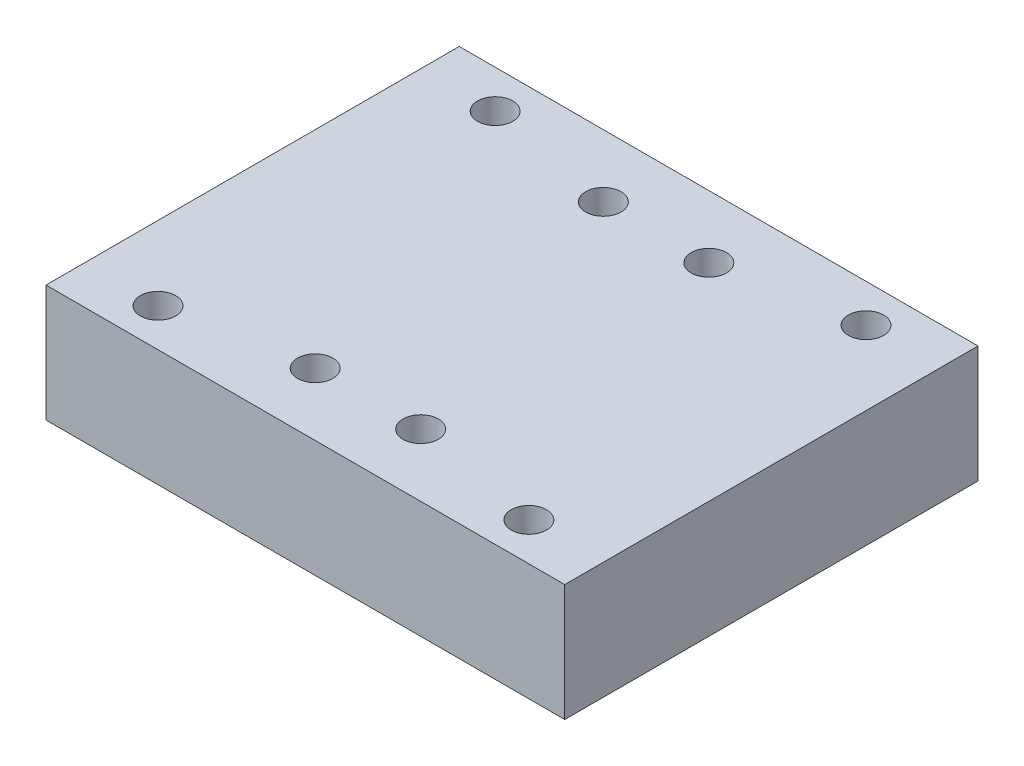
ISO-10303-21;
HEADER;
FILE_DESCRIPTION(('STEP AP214'),'2;1');
FILE_NAME('part.step','',(''),(''),'','','');
FILE_SCHEMA(('AUTOMOTIVE_DESIGN { 1 0 10303 214 1 1 1 1 }'));
ENDSEC;
DATA;
#1=APPLICATION_CONTEXT('core data for automotive mechanical design processes');
#2=APPLICATION_PROTOCOL_DEFINITION('international standard','automotive_design',2000,#1);
#3=PRODUCT_CONTEXT('',#1,'mechanical');
#4=PRODUCT('Part','Part','',(#3));
#5=PRODUCT_RELATED_PRODUCT_CATEGORY('part','',(#4));
#6=PRODUCT_DEFINITION_FORMATION('','',#4);
#7=PRODUCT_DEFINITION_CONTEXT('part definition',#1,'design');
#8=PRODUCT_DEFINITION('design','',#6,#7);
#9=PRODUCT_DEFINITION_SHAPE('','',#8);
#10=(LENGTH_UNIT() NAMED_UNIT(*) SI_UNIT(.MILLI.,.METRE.));
#11=(NAMED_UNIT(*) PLANE_ANGLE_UNIT() SI_UNIT($,.RADIAN.));
#12=(NAMED_UNIT(*) SI_UNIT($,.STERADIAN.) SOLID_ANGLE_UNIT());
#13=UNCERTAINTY_MEASURE_WITH_UNIT(LENGTH_MEASURE(1.E-05),#10,'distance_accuracy_value','');
#14=(GEOMETRIC_REPRESENTATION_CONTEXT(3) GLOBAL_UNCERTAINTY_ASSIGNED_CONTEXT((#13)) GLOBAL_UNIT_ASSIGNED_CONTEXT((#10,
#11,#12)) REPRESENTATION_CONTEXT('',''));
#15=CARTESIAN_POINT('',(0.,0.,0.));
#16=DIRECTION('',(0.,0.,1.));
#17=DIRECTION('',(1.,0.,0.));
#18=AXIS2_PLACEMENT_3D('',#15,#16,#17);
#19=CARTESIAN_POINT('',(47.7,21.5,38.));
#20=DIRECTION('',(-1.,0.,0.));
#21=DIRECTION('',(0.,0.,1.));
#22=AXIS2_PLACEMENT_3D('',#19,#20,#21);
#23=PLANE('',#22);
#24=DIRECTION('',(0.,0.,-1.));
#25=VECTOR('',#24,1.);
#26=CARTESIAN_POINT('',(47.7,0.,38.));
#27=LINE('',#26,#25);
#28=CARTESIAN_POINT('',(47.7,0.,38.));
#29=VERTEX_POINT('',#28);
#30=CARTESIAN_POINT('',(47.7,0.,-38.));
#31=VERTEX_POINT('',#30);
#32=EDGE_CURVE('E110',#29,#31,#27,.T.);
#33=ORIENTED_EDGE('',*,*,#32,.T.);
#34=DIRECTION('',(0.,-1.,0.));
#35=VECTOR('',#34,1.);
#36=CARTESIAN_POINT('',(47.7,21.5,-38.));
#37=LINE('',#36,#35);
#38=CARTESIAN_POINT('',(47.7,21.5,-38.));
#39=VERTEX_POINT('',#38);
#40=EDGE_CURVE('E11',#39,#31,#37,.T.);
#41=ORIENTED_EDGE('',*,*,#40,.F.);
#42=DIRECTION('',(0.,0.,-1.));
#43=VECTOR('',#42,1.);
#44=CARTESIAN_POINT('',(47.7,21.5,38.));
#45=LINE('',#44,#43);
#46=CARTESIAN_POINT('',(47.7,21.5,38.));
#47=VERTEX_POINT('',#46);
#48=EDGE_CURVE('E94',#47,#39,#45,.T.);
#49=ORIENTED_EDGE('',*,*,#48,.F.);
#50=DIRECTION('',(0.,-1.,0.));
#51=VECTOR('',#50,1.);
#52=CARTESIAN_POINT('',(47.7,21.5,38.));
#53=LINE('',#52,#51);
#54=EDGE_CURVE('E106',#47,#29,#53,.T.);
#55=ORIENTED_EDGE('',*,*,#54,.T.);
#56=EDGE_LOOP('',(#33,#41,#49,#55));
#57=FACE_BOUND('',#56,.T.);
#58=ADVANCED_FACE('F42',(#57),#23,.F.);
#59=CARTESIAN_POINT('',(-47.7,21.5,-38.));
#60=DIRECTION('',(0.,0.,1.));
#61=DIRECTION('',(1.,0.,0.));
#62=AXIS2_PLACEMENT_3D('',#59,#60,#61);
#63=PLANE('',#62);
#64=DIRECTION('',(-1.,0.,0.));
#65=VECTOR('',#64,1.);
#66=CARTESIAN_POINT('',(-47.7,0.,-38.));
#67=LINE('',#66,#65);
#68=CARTESIAN_POINT('',(-47.7,0.,-38.));
#69=VERTEX_POINT('',#68);
#70=EDGE_CURVE('E99',#31,#69,#67,.T.);
#71=ORIENTED_EDGE('',*,*,#70,.T.);
#72=DIRECTION('',(0.,-1.,0.));
#73=VECTOR('',#72,1.);
#74=CARTESIAN_POINT('',(-47.7,21.5,-38.));
#75=LINE('',#74,#73);
#76=CARTESIAN_POINT('',(-47.7,21.5,-38.));
#77=VERTEX_POINT('',#76);
#78=EDGE_CURVE('E51',#77,#69,#75,.T.);
#79=ORIENTED_EDGE('',*,*,#78,.F.);
#80=DIRECTION('',(-1.,0.,0.));
#81=VECTOR('',#80,1.);
#82=CARTESIAN_POINT('',(-47.7,21.5,-38.));
#83=LINE('',#82,#81);
#84=EDGE_CURVE('E89',#39,#77,#83,.T.);
#85=ORIENTED_EDGE('',*,*,#84,.F.);
#86=ORIENTED_EDGE('',*,*,#40,.T.);
#87=EDGE_LOOP('',(#71,#79,#85,#86));
#88=FACE_BOUND('',#87,.T.);
#89=ADVANCED_FACE('F98',(#88),#63,.F.);
#90=CARTESIAN_POINT('',(-47.7,21.5,38.));
#91=DIRECTION('',(1.,0.,0.));
#92=DIRECTION('',(0.,0.,-1.));
#93=AXIS2_PLACEMENT_3D('',#90,#91,#92);
#94=PLANE('',#93);
#95=DIRECTION('',(0.,0.,1.));
#96=VECTOR('',#95,1.);
#97=CARTESIAN_POINT('',(-47.7,0.,38.));
#98=LINE('',#97,#96);
#99=CARTESIAN_POINT('',(-47.7,0.,38.));
#100=VERTEX_POINT('',#99);
#101=EDGE_CURVE('E76',#69,#100,#98,.T.);
#102=ORIENTED_EDGE('',*,*,#101,.T.);
#103=DIRECTION('',(0.,-1.,0.));
#104=VECTOR('',#103,1.);
#105=CARTESIAN_POINT('',(-47.7,21.5,38.));
#106=LINE('',#105,#104);
#107=CARTESIAN_POINT('',(-47.7,21.5,38.));
#108=VERTEX_POINT('',#107);
#109=EDGE_CURVE('E101',#108,#100,#106,.T.);
#110=ORIENTED_EDGE('',*,*,#109,.F.);
#111=DIRECTION('',(0.,0.,1.));
#112=VECTOR('',#111,1.);
#113=CARTESIAN_POINT('',(-47.7,21.5,38.));
#114=LINE('',#113,#112);
#115=EDGE_CURVE('E92',#77,#108,#114,.T.);
#116=ORIENTED_EDGE('',*,*,#115,.F.);
#117=ORIENTED_EDGE('',*,*,#78,.T.);
#118=EDGE_LOOP('',(#102,#110,#116,#117));
#119=FACE_BOUND('',#118,.T.);
#120=ADVANCED_FACE('F102',(#119),#94,.F.);
#121=CARTESIAN_POINT('',(-47.7,21.5,38.));
#122=DIRECTION('',(0.,0.,-1.));
#123=DIRECTION('',(-1.,0.,0.));
#124=AXIS2_PLACEMENT_3D('',#121,#122,#123);
#125=PLANE('',#124);
#126=DIRECTION('',(1.,0.,0.));
#127=VECTOR('',#126,1.);
#128=CARTESIAN_POINT('',(-47.7,0.,38.));
#129=LINE('',#128,#127);
#130=EDGE_CURVE('E82',#100,#29,#129,.T.);
#131=ORIENTED_EDGE('',*,*,#130,.T.);
#132=ORIENTED_EDGE('',*,*,#54,.F.);
#133=DIRECTION('',(1.,0.,0.));
#134=VECTOR('',#133,1.);
#135=CARTESIAN_POINT('',(-47.7,21.5,38.));
#136=LINE('',#135,#134);
#137=EDGE_CURVE('E59',#108,#47,#136,.T.);
#138=ORIENTED_EDGE('',*,*,#137,.F.);
#139=ORIENTED_EDGE('',*,*,#109,.T.);
#140=EDGE_LOOP('',(#131,#132,#138,#139));
#141=FACE_BOUND('',#140,.T.);
#142=ADVANCED_FACE('F124',(#141),#125,.F.);
#143=CARTESIAN_POINT('',(0.,21.5,0.));
#144=DIRECTION('',(0.,-1.,0.));
#145=DIRECTION('',(0.,0.,-1.));
#146=AXIS2_PLACEMENT_3D('',#143,#144,#145);
#147=PLANE('',#146);
#148=CARTESIAN_POINT('',(34.1,21.5,31.));
#149=DIRECTION('',(0.,1.,0.));
#150=DIRECTION('',(0.,0.,-1.));
#151=AXIS2_PLACEMENT_3D('',#148,#149,#150);
#152=CIRCLE('',#151,3.25);
#153=CARTESIAN_POINT('',(34.1,21.5,27.75));
#154=VERTEX_POINT('',#153);
#155=EDGE_CURVE('E187',#154,#154,#152,.T.);
#156=ORIENTED_EDGE('',*,*,#155,.F.);
#157=EDGE_LOOP('',(#156));
#158=FACE_BOUND('',#157,.T.);
#159=CARTESIAN_POINT('',(9.70000000000002,21.5,26.5));
#160=DIRECTION('',(0.,1.,0.));
#161=DIRECTION('',(0.,0.,-1.));
#162=AXIS2_PLACEMENT_3D('',#159,#160,#161);
#163=CIRCLE('',#162,3.25);
#164=CARTESIAN_POINT('',(9.70000000000002,21.5,23.25));
#165=VERTEX_POINT('',#164);
#166=EDGE_CURVE('E179',#165,#165,#163,.T.);
#167=ORIENTED_EDGE('',*,*,#166,.F.);
#168=EDGE_LOOP('',(#167));
#169=FACE_BOUND('',#168,.T.);
#170=CARTESIAN_POINT('',(34.1,21.5,-31.));
#171=DIRECTION('',(0.,-1.,0.));
#172=DIRECTION('',(0.,0.,1.));
#173=AXIS2_PLACEMENT_3D('',#170,#171,#172);
#174=CIRCLE('',#173,3.25);
#175=CARTESIAN_POINT('',(34.1,21.5,-27.75));
#176=VERTEX_POINT('',#175);
#177=EDGE_CURVE('E172',#176,#176,#174,.T.);
#178=ORIENTED_EDGE('',*,*,#177,.T.);
#179=EDGE_LOOP('',(#178));
#180=FACE_BOUND('',#179,.T.);
#181=CARTESIAN_POINT('',(9.70000000000002,21.5,-26.5));
#182=DIRECTION('',(0.,-1.,0.));
#183=DIRECTION('',(0.,0.,1.));
#184=AXIS2_PLACEMENT_3D('',#181,#182,#183);
#185=CIRCLE('',#184,3.25);
#186=CARTESIAN_POINT('',(9.70000000000002,21.5,-23.25));
#187=VERTEX_POINT('',#186);
#188=EDGE_CURVE('E163',#187,#187,#185,.T.);
#189=ORIENTED_EDGE('',*,*,#188,.T.);
#190=EDGE_LOOP('',(#189));
#191=FACE_BOUND('',#190,.T.);
#192=CARTESIAN_POINT('',(-34.1,21.5,31.));
#193=DIRECTION('',(0.,-1.,0.));
#194=DIRECTION('',(0.,0.,-1.));
#195=AXIS2_PLACEMENT_3D('',#192,#193,#194);
#196=CIRCLE('',#195,3.25);
#197=CARTESIAN_POINT('',(-34.1,21.5,27.75));
#198=VERTEX_POINT('',#197);
#199=EDGE_CURVE('E156',#198,#198,#196,.T.);
#200=ORIENTED_EDGE('',*,*,#199,.T.);
#201=EDGE_LOOP('',(#200));
#202=FACE_BOUND('',#201,.T.);
#203=CARTESIAN_POINT('',(-9.70000000000002,21.5,26.5));
#204=DIRECTION('',(0.,-1.,0.));
#205=DIRECTION('',(0.,0.,-1.));
#206=AXIS2_PLACEMENT_3D('',#203,#204,#205);
#207=CIRCLE('',#206,3.25);
#208=CARTESIAN_POINT('',(-9.70000000000002,21.5,23.25));
#209=VERTEX_POINT('',#208);
#210=EDGE_CURVE('E147',#209,#209,#207,.T.);
#211=ORIENTED_EDGE('',*,*,#210,.T.);
#212=EDGE_LOOP('',(#211));
#213=FACE_BOUND('',#212,.T.);
#214=CARTESIAN_POINT('',(-34.1,21.5,-31.));
#215=DIRECTION('',(0.,1.,0.));
#216=DIRECTION('',(0.,0.,1.));
#217=AXIS2_PLACEMENT_3D('',#214,#215,#216);
#218=CIRCLE('',#217,3.25);
#219=CARTESIAN_POINT('',(-34.1,21.5,-27.75));
#220=VERTEX_POINT('',#219);
#221=EDGE_CURVE('E140',#220,#220,#218,.T.);
#222=ORIENTED_EDGE('',*,*,#221,.F.);
#223=EDGE_LOOP('',(#222));
#224=FACE_BOUND('',#223,.T.);
#225=CARTESIAN_POINT('',(-9.70000000000002,21.5,-26.5));
#226=DIRECTION('',(0.,1.,0.));
#227=DIRECTION('',(0.,0.,1.));
#228=AXIS2_PLACEMENT_3D('',#225,#226,#227);
#229=CIRCLE('',#228,3.25);
#230=CARTESIAN_POINT('',(-9.70000000000002,21.5,-23.25));
#231=VERTEX_POINT('',#230);
#232=EDGE_CURVE('E135',#231,#231,#229,.T.);
#233=ORIENTED_EDGE('',*,*,#232,.F.);
#234=EDGE_LOOP('',(#233));
#235=FACE_BOUND('',#234,.T.);
#236=ORIENTED_EDGE('',*,*,#48,.T.);
#237=ORIENTED_EDGE('',*,*,#84,.T.);
#238=ORIENTED_EDGE('',*,*,#115,.T.);
#239=ORIENTED_EDGE('',*,*,#137,.T.);
#240=EDGE_LOOP('',(#236,#237,#238,#239));
#241=FACE_BOUND('',#240,.T.);
#242=ADVANCED_FACE('F90',(#158,#169,#180,#191,#202,#213,#224,#235,#241),#147,.F.);
#243=CARTESIAN_POINT('',(0.,0.,0.));
#244=DIRECTION('',(0.,-1.,0.));
#245=DIRECTION('',(0.,0.,-1.));
#246=AXIS2_PLACEMENT_3D('',#243,#244,#245);
#247=PLANE('',#246);
#248=CARTESIAN_POINT('',(34.1,0.,31.));
#249=DIRECTION('',(0.,1.,0.));
#250=DIRECTION('',(0.,0.,-1.));
#251=AXIS2_PLACEMENT_3D('',#248,#249,#250);
#252=CIRCLE('',#251,3.25);
#253=CARTESIAN_POINT('',(34.1,0.,27.75));
#254=VERTEX_POINT('',#253);
#255=EDGE_CURVE('E168',#254,#254,#252,.T.);
#256=ORIENTED_EDGE('',*,*,#255,.T.);
#257=EDGE_LOOP('',(#256));
#258=FACE_BOUND('',#257,.T.);
#259=CARTESIAN_POINT('',(9.70000000000002,0.,26.5));
#260=DIRECTION('',(0.,1.,0.));
#261=DIRECTION('',(0.,0.,-1.));
#262=AXIS2_PLACEMENT_3D('',#259,#260,#261);
#263=CIRCLE('',#262,3.25);
#264=CARTESIAN_POINT('',(9.70000000000002,0.,23.25));
#265=VERTEX_POINT('',#264);
#266=EDGE_CURVE('E183',#265,#265,#263,.T.);
#267=ORIENTED_EDGE('',*,*,#266,.T.);
#268=EDGE_LOOP('',(#267));
#269=FACE_BOUND('',#268,.T.);
#270=CARTESIAN_POINT('',(34.1,0.,-31.));
#271=DIRECTION('',(0.,-1.,0.));
#272=DIRECTION('',(0.,0.,1.));
#273=AXIS2_PLACEMENT_3D('',#270,#271,#272);
#274=CIRCLE('',#273,3.25);
#275=CARTESIAN_POINT('',(34.1,0.,-27.75));
#276=VERTEX_POINT('',#275);
#277=EDGE_CURVE('E152',#276,#276,#274,.T.);
#278=ORIENTED_EDGE('',*,*,#277,.F.);
#279=EDGE_LOOP('',(#278));
#280=FACE_BOUND('',#279,.T.);
#281=CARTESIAN_POINT('',(9.70000000000002,0.,-26.5));
#282=DIRECTION('',(0.,-1.,0.));
#283=DIRECTION('',(0.,0.,1.));
#284=AXIS2_PLACEMENT_3D('',#281,#282,#283);
#285=CIRCLE('',#284,3.25);
#286=CARTESIAN_POINT('',(9.70000000000002,0.,-23.25));
#287=VERTEX_POINT('',#286);
#288=EDGE_CURVE('E167',#287,#287,#285,.T.);
#289=ORIENTED_EDGE('',*,*,#288,.F.);
#290=EDGE_LOOP('',(#289));
#291=FACE_BOUND('',#290,.T.);
#292=CARTESIAN_POINT('',(-34.1,0.,31.));
#293=DIRECTION('',(0.,-1.,0.));
#294=DIRECTION('',(0.,0.,-1.));
#295=AXIS2_PLACEMENT_3D('',#292,#293,#294);
#296=CIRCLE('',#295,3.25);
#297=CARTESIAN_POINT('',(-34.1,0.,27.75));
#298=VERTEX_POINT('',#297);
#299=EDGE_CURVE('E136',#298,#298,#296,.T.);
#300=ORIENTED_EDGE('',*,*,#299,.F.);
#301=EDGE_LOOP('',(#300));
#302=FACE_BOUND('',#301,.T.);
#303=CARTESIAN_POINT('',(-9.70000000000002,0.,26.5));
#304=DIRECTION('',(0.,-1.,0.));
#305=DIRECTION('',(0.,0.,-1.));
#306=AXIS2_PLACEMENT_3D('',#303,#304,#305);
#307=CIRCLE('',#306,3.25);
#308=CARTESIAN_POINT('',(-9.70000000000002,0.,23.25));
#309=VERTEX_POINT('',#308);
#310=EDGE_CURVE('E151',#309,#309,#307,.T.);
#311=ORIENTED_EDGE('',*,*,#310,.F.);
#312=EDGE_LOOP('',(#311));
#313=FACE_BOUND('',#312,.T.);
#314=CARTESIAN_POINT('',(-34.1,0.,-31.));
#315=DIRECTION('',(0.,1.,0.));
#316=DIRECTION('',(0.,0.,1.));
#317=AXIS2_PLACEMENT_3D('',#314,#315,#316);
#318=CIRCLE('',#317,3.25);
#319=CARTESIAN_POINT('',(-34.1,0.,-27.75));
#320=VERTEX_POINT('',#319);
#321=EDGE_CURVE('E114',#320,#320,#318,.T.);
#322=ORIENTED_EDGE('',*,*,#321,.T.);
#323=EDGE_LOOP('',(#322));
#324=FACE_BOUND('',#323,.T.);
#325=CARTESIAN_POINT('',(-9.70000000000002,0.,-26.5));
#326=DIRECTION('',(0.,1.,0.));
#327=DIRECTION('',(0.,0.,1.));
#328=AXIS2_PLACEMENT_3D('',#325,#326,#327);
#329=CIRCLE('',#328,3.25);
#330=CARTESIAN_POINT('',(-9.70000000000002,0.,-23.25));
#331=VERTEX_POINT('',#330);
#332=EDGE_CURVE('E131',#331,#331,#329,.T.);
#333=ORIENTED_EDGE('',*,*,#332,.T.);
#334=EDGE_LOOP('',(#333));
#335=FACE_BOUND('',#334,.T.);
#336=ORIENTED_EDGE('',*,*,#32,.F.);
#337=ORIENTED_EDGE('',*,*,#130,.F.);
#338=ORIENTED_EDGE('',*,*,#101,.F.);
#339=ORIENTED_EDGE('',*,*,#70,.F.);
#340=EDGE_LOOP('',(#336,#337,#338,#339));
#341=FACE_BOUND('',#340,.T.);
#342=ADVANCED_FACE('F127',(#258,#269,#280,#291,#302,#313,#324,#335,#341),#247,.T.);
#343=CARTESIAN_POINT('',(-9.70000000000002,0.,-26.5));
#344=DIRECTION('',(0.,1.,0.));
#345=DIRECTION('',(0.,0.,1.));
#346=AXIS2_PLACEMENT_3D('',#343,#344,#345);
#347=CYLINDRICAL_SURFACE('',#346,3.25);
#348=ORIENTED_EDGE('',*,*,#332,.F.);
#349=EDGE_LOOP('',(#348));
#350=FACE_BOUND('',#349,.T.);
#351=ORIENTED_EDGE('',*,*,#232,.T.);
#352=EDGE_LOOP('',(#351));
#353=FACE_BOUND('',#352,.T.);
#354=ADVANCED_FACE('F221',(#350,#353),#347,.F.);
#355=CARTESIAN_POINT('',(-34.1,0.,-31.));
#356=DIRECTION('',(0.,1.,0.));
#357=DIRECTION('',(0.,0.,1.));
#358=AXIS2_PLACEMENT_3D('',#355,#356,#357);
#359=CYLINDRICAL_SURFACE('',#358,3.25);
#360=ORIENTED_EDGE('',*,*,#321,.F.);
#361=EDGE_LOOP('',(#360));
#362=FACE_BOUND('',#361,.T.);
#363=ORIENTED_EDGE('',*,*,#221,.T.);
#364=EDGE_LOOP('',(#363));
#365=FACE_BOUND('',#364,.T.);
#366=ADVANCED_FACE('F223',(#362,#365),#359,.F.);
#367=CARTESIAN_POINT('',(-9.70000000000002,0.,26.5));
#368=DIRECTION('',(0.,1.,0.));
#369=DIRECTION('',(0.,0.,1.));
#370=AXIS2_PLACEMENT_3D('',#367,#368,#369);
#371=CYLINDRICAL_SURFACE('',#370,3.25);
#372=ORIENTED_EDGE('',*,*,#310,.T.);
#373=EDGE_LOOP('',(#372));
#374=FACE_BOUND('',#373,.T.);
#375=ORIENTED_EDGE('',*,*,#210,.F.);
#376=EDGE_LOOP('',(#375));
#377=FACE_BOUND('',#376,.T.);
#378=ADVANCED_FACE('F230',(#374,#377),#371,.F.);
#379=CARTESIAN_POINT('',(-34.1,0.,31.));
#380=DIRECTION('',(0.,1.,0.));
#381=DIRECTION('',(0.,0.,1.));
#382=AXIS2_PLACEMENT_3D('',#379,#380,#381);
#383=CYLINDRICAL_SURFACE('',#382,3.25);
#384=ORIENTED_EDGE('',*,*,#299,.T.);
#385=EDGE_LOOP('',(#384));
#386=FACE_BOUND('',#385,.T.);
#387=ORIENTED_EDGE('',*,*,#199,.F.);
#388=EDGE_LOOP('',(#387));
#389=FACE_BOUND('',#388,.T.);
#390=ADVANCED_FACE('F272',(#386,#389),#383,.F.);
#391=CARTESIAN_POINT('',(9.70000000000002,0.,-26.5));
#392=DIRECTION('',(0.,1.,0.));
#393=DIRECTION('',(0.,0.,1.));
#394=AXIS2_PLACEMENT_3D('',#391,#392,#393);
#395=CYLINDRICAL_SURFACE('',#394,3.25);
#396=ORIENTED_EDGE('',*,*,#288,.T.);
#397=EDGE_LOOP('',(#396));
#398=FACE_BOUND('',#397,.T.);
#399=ORIENTED_EDGE('',*,*,#188,.F.);
#400=EDGE_LOOP('',(#399));
#401=FACE_BOUND('',#400,.T.);
#402=ADVANCED_FACE('F284',(#398,#401),#395,.F.);
#403=CARTESIAN_POINT('',(34.1,0.,-31.));
#404=DIRECTION('',(0.,1.,0.));
#405=DIRECTION('',(0.,0.,1.));
#406=AXIS2_PLACEMENT_3D('',#403,#404,#405);
#407=CYLINDRICAL_SURFACE('',#406,3.25);
#408=ORIENTED_EDGE('',*,*,#277,.T.);
#409=EDGE_LOOP('',(#408));
#410=FACE_BOUND('',#409,.T.);
#411=ORIENTED_EDGE('',*,*,#177,.F.);
#412=EDGE_LOOP('',(#411));
#413=FACE_BOUND('',#412,.T.);
#414=ADVANCED_FACE('F295',(#410,#413),#407,.F.);
#415=CARTESIAN_POINT('',(9.70000000000002,0.,26.5));
#416=DIRECTION('',(0.,1.,0.));
#417=DIRECTION('',(0.,0.,1.));
#418=AXIS2_PLACEMENT_3D('',#415,#416,#417);
#419=CYLINDRICAL_SURFACE('',#418,3.25);
#420=ORIENTED_EDGE('',*,*,#266,.F.);
#421=EDGE_LOOP('',(#420));
#422=FACE_BOUND('',#421,.T.);
#423=ORIENTED_EDGE('',*,*,#166,.T.);
#424=EDGE_LOOP('',(#423));
#425=FACE_BOUND('',#424,.T.);
#426=ADVANCED_FACE('F200',(#422,#425),#419,.F.);
#427=CARTESIAN_POINT('',(34.1,0.,31.));
#428=DIRECTION('',(0.,1.,0.));
#429=DIRECTION('',(0.,0.,1.));
#430=AXIS2_PLACEMENT_3D('',#427,#428,#429);
#431=CYLINDRICAL_SURFACE('',#430,3.25);
#432=ORIENTED_EDGE('',*,*,#255,.F.);
#433=EDGE_LOOP('',(#432));
#434=FACE_BOUND('',#433,.T.);
#435=ORIENTED_EDGE('',*,*,#155,.T.);
#436=EDGE_LOOP('',(#435));
#437=FACE_BOUND('',#436,.T.);
#438=ADVANCED_FACE('F197',(#434,#437),#431,.F.);
#439=CLOSED_SHELL('',(#58,#89,#120,#142,#242,#342,#354,#366,#378,#390,#402,#414,#426,#438));
#440=MANIFOLD_SOLID_BREP('B2',#439);
#441=ADVANCED_BREP_SHAPE_REPRESENTATION('',(#18,#440),#14);
#442=SHAPE_DEFINITION_REPRESENTATION(#9,#441);
ENDSEC;
END-ISO-10303-21;
